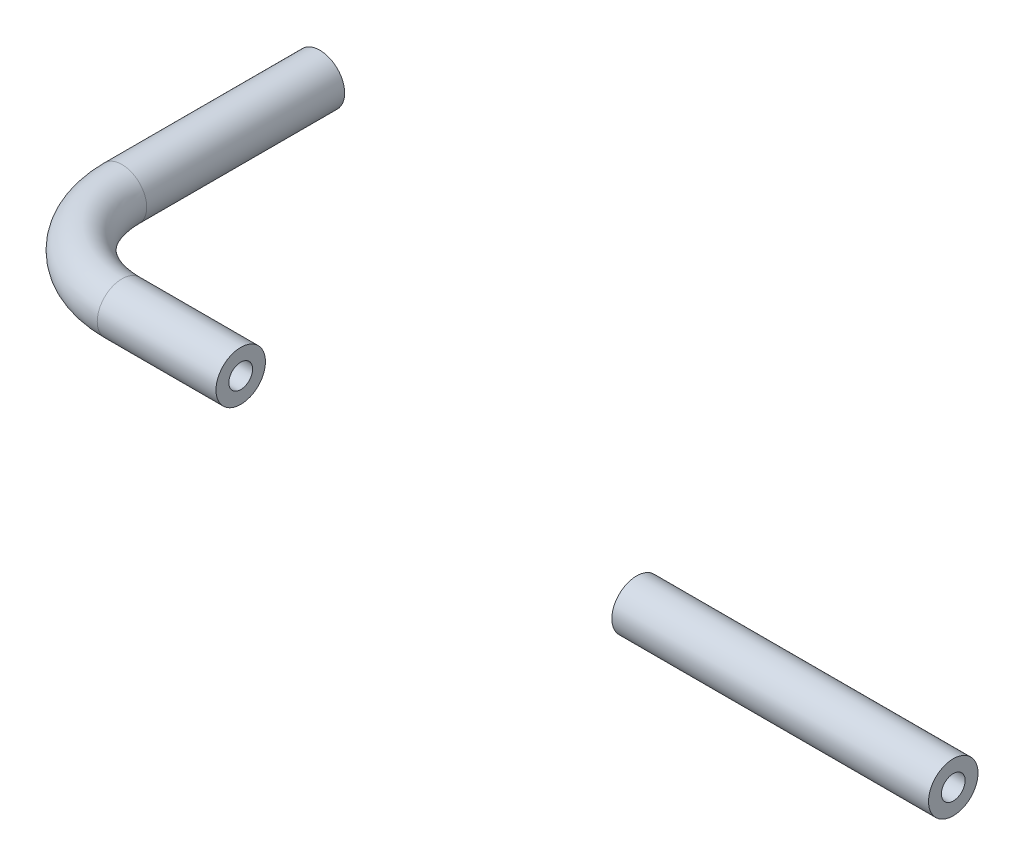
ISO-10303-21;
HEADER;
FILE_DESCRIPTION(('STEP AP214'),'2;1');
FILE_NAME('part.step','',(''),(''),'','','');
FILE_SCHEMA(('AUTOMOTIVE_DESIGN { 1 0 10303 214 1 1 1 1 }'));
ENDSEC;
DATA;
#1=APPLICATION_CONTEXT('core data for automotive mechanical design processes');
#2=APPLICATION_PROTOCOL_DEFINITION('international standard','automotive_design',2000,#1);
#3=PRODUCT_CONTEXT('',#1,'mechanical');
#4=PRODUCT('Part','Part','',(#3));
#5=PRODUCT_RELATED_PRODUCT_CATEGORY('part','',(#4));
#6=PRODUCT_DEFINITION_FORMATION('','',#4);
#7=PRODUCT_DEFINITION_CONTEXT('part definition',#1,'design');
#8=PRODUCT_DEFINITION('design','',#6,#7);
#9=PRODUCT_DEFINITION_SHAPE('','',#8);
#10=(LENGTH_UNIT() NAMED_UNIT(*) SI_UNIT(.MILLI.,.METRE.));
#11=(NAMED_UNIT(*) PLANE_ANGLE_UNIT() SI_UNIT($,.RADIAN.));
#12=(NAMED_UNIT(*) SI_UNIT($,.STERADIAN.) SOLID_ANGLE_UNIT());
#13=UNCERTAINTY_MEASURE_WITH_UNIT(LENGTH_MEASURE(1.E-05),#10,'distance_accuracy_value','');
#14=(GEOMETRIC_REPRESENTATION_CONTEXT(3) GLOBAL_UNCERTAINTY_ASSIGNED_CONTEXT((#13)) GLOBAL_UNIT_ASSIGNED_CONTEXT((#10,
#11,#12)) REPRESENTATION_CONTEXT('',''));
#15=CARTESIAN_POINT('',(0.,0.,0.));
#16=DIRECTION('',(0.,0.,1.));
#17=DIRECTION('',(1.,0.,0.));
#18=AXIS2_PLACEMENT_3D('',#15,#16,#17);
#19=CARTESIAN_POINT('',(50.8,0.,0.));
#20=DIRECTION('',(1.,0.,0.));
#21=DIRECTION('',(0.,0.,-1.));
#22=AXIS2_PLACEMENT_3D('',#19,#20,#21);
#23=PLANE('',#22);
#24=CARTESIAN_POINT('',(50.8,0.,0.));
#25=DIRECTION('',(1.,0.,0.));
#26=DIRECTION('',(0.,0.,-1.));
#27=AXIS2_PLACEMENT_3D('',#24,#25,#26);
#28=CIRCLE('',#27,1.524);
#29=CARTESIAN_POINT('',(50.8,0.,-1.524));
#30=VERTEX_POINT('',#29);
#31=EDGE_CURVE('E71',#30,#30,#28,.T.);
#32=ORIENTED_EDGE('',*,*,#31,.T.);
#33=EDGE_LOOP('',(#32));
#34=FACE_BOUND('',#33,.T.);
#35=CARTESIAN_POINT('',(50.8,0.,0.));
#36=DIRECTION('',(1.,0.,0.));
#37=DIRECTION('',(0.,0.,-1.));
#38=AXIS2_PLACEMENT_3D('',#35,#36,#37);
#39=CIRCLE('',#38,3.175);
#40=CARTESIAN_POINT('',(50.8,0.,-3.175));
#41=VERTEX_POINT('',#40);
#42=EDGE_CURVE('E63',#41,#41,#39,.T.);
#43=ORIENTED_EDGE('',*,*,#42,.F.);
#44=EDGE_LOOP('',(#43));
#45=FACE_BOUND('',#44,.T.);
#46=ADVANCED_FACE('F57',(#34,#45),#23,.F.);
#47=CARTESIAN_POINT('',(91.44,0.,0.));
#48=DIRECTION('',(1.,0.,0.));
#49=DIRECTION('',(0.,0.,-1.));
#50=AXIS2_PLACEMENT_3D('',#47,#48,#49);
#51=PLANE('',#50);
#52=CARTESIAN_POINT('',(91.44,0.,0.));
#53=DIRECTION('',(1.,0.,0.));
#54=DIRECTION('',(0.,0.,-1.));
#55=AXIS2_PLACEMENT_3D('',#52,#53,#54);
#56=CIRCLE('',#55,1.524);
#57=CARTESIAN_POINT('',(91.44,0.,-1.524));
#58=VERTEX_POINT('',#57);
#59=EDGE_CURVE('E67',#58,#58,#56,.T.);
#60=ORIENTED_EDGE('',*,*,#59,.F.);
#61=EDGE_LOOP('',(#60));
#62=FACE_BOUND('',#61,.T.);
#63=CARTESIAN_POINT('',(91.44,0.,0.));
#64=DIRECTION('',(1.,0.,0.));
#65=DIRECTION('',(0.,0.,-1.));
#66=AXIS2_PLACEMENT_3D('',#63,#64,#65);
#67=CIRCLE('',#66,3.175);
#68=CARTESIAN_POINT('',(91.44,0.,-3.175));
#69=VERTEX_POINT('',#68);
#70=EDGE_CURVE('E12',#69,#69,#67,.T.);
#71=ORIENTED_EDGE('',*,*,#70,.T.);
#72=EDGE_LOOP('',(#71));
#73=FACE_BOUND('',#72,.T.);
#74=ADVANCED_FACE('F87',(#62,#73),#51,.T.);
#75=CARTESIAN_POINT('',(50.8,0.,0.));
#76=DIRECTION('',(1.,0.,0.));
#77=DIRECTION('',(0.,0.,-1.));
#78=AXIS2_PLACEMENT_3D('',#75,#76,#77);
#79=CYLINDRICAL_SURFACE('',#78,3.175);
#80=ORIENTED_EDGE('',*,*,#70,.F.);
#81=EDGE_LOOP('',(#80));
#82=FACE_BOUND('',#81,.T.);
#83=ORIENTED_EDGE('',*,*,#42,.T.);
#84=EDGE_LOOP('',(#83));
#85=FACE_BOUND('',#84,.T.);
#86=ADVANCED_FACE('F81',(#82,#85),#79,.T.);
#87=CARTESIAN_POINT('',(50.8,0.,0.));
#88=DIRECTION('',(1.,0.,0.));
#89=DIRECTION('',(0.,0.,-1.));
#90=AXIS2_PLACEMENT_3D('',#87,#88,#89);
#91=CYLINDRICAL_SURFACE('',#90,1.524);
#92=ORIENTED_EDGE('',*,*,#59,.T.);
#93=EDGE_LOOP('',(#92));
#94=FACE_BOUND('',#93,.T.);
#95=ORIENTED_EDGE('',*,*,#31,.F.);
#96=EDGE_LOOP('',(#95));
#97=FACE_BOUND('',#96,.T.);
#98=ADVANCED_FACE('F79',(#94,#97),#91,.F.);
#99=CLOSED_SHELL('',(#46,#74,#86,#98));
#100=MANIFOLD_SOLID_BREP('B2',#99);
#101=CARTESIAN_POINT('',(-27.94,0.,-38.1));
#102=DIRECTION('',(0.,0.,-1.));
#103=DIRECTION('',(-1.,0.,0.));
#104=AXIS2_PLACEMENT_3D('',#101,#102,#103);
#105=PLANE('',#104);
#106=CARTESIAN_POINT('',(-27.94,0.,-38.1));
#107=DIRECTION('',(0.,0.,-1.));
#108=DIRECTION('',(-1.,0.,0.));
#109=AXIS2_PLACEMENT_3D('',#106,#107,#108);
#110=CIRCLE('',#109,1.524);
#111=CARTESIAN_POINT('',(-29.464,0.,-38.1));
#112=VERTEX_POINT('',#111);
#113=EDGE_CURVE('E142',#112,#112,#110,.T.);
#114=ORIENTED_EDGE('',*,*,#113,.F.);
#115=EDGE_LOOP('',(#114));
#116=FACE_BOUND('',#115,.T.);
#117=CARTESIAN_POINT('',(-27.94,0.,-38.1));
#118=DIRECTION('',(0.,0.,-1.));
#119=DIRECTION('',(-1.,0.,0.));
#120=AXIS2_PLACEMENT_3D('',#117,#118,#119);
#121=CIRCLE('',#120,3.175);
#122=CARTESIAN_POINT('',(-31.115,0.,-38.1));
#123=VERTEX_POINT('',#122);
#124=EDGE_CURVE('E133',#123,#123,#121,.T.);
#125=ORIENTED_EDGE('',*,*,#124,.T.);
#126=EDGE_LOOP('',(#125));
#127=FACE_BOUND('',#126,.T.);
#128=ADVANCED_FACE('F119',(#116,#127),#105,.T.);
#129=CARTESIAN_POINT('',(0.,0.,0.));
#130=DIRECTION('',(-1.,0.,0.));
#131=DIRECTION('',(0.,0.,1.));
#132=AXIS2_PLACEMENT_3D('',#129,#130,#131);
#133=PLANE('',#132);
#134=CARTESIAN_POINT('',(0.,0.,0.));
#135=DIRECTION('',(-1.,0.,0.));
#136=DIRECTION('',(0.,0.,1.));
#137=AXIS2_PLACEMENT_3D('',#134,#135,#136);
#138=CIRCLE('',#137,1.524);
#139=CARTESIAN_POINT('',(0.,0.,1.524));
#140=VERTEX_POINT('',#139);
#141=EDGE_CURVE('E138',#140,#140,#138,.T.);
#142=ORIENTED_EDGE('',*,*,#141,.T.);
#143=EDGE_LOOP('',(#142));
#144=FACE_BOUND('',#143,.T.);
#145=CARTESIAN_POINT('',(0.,0.,0.));
#146=DIRECTION('',(-1.,0.,0.));
#147=DIRECTION('',(0.,0.,1.));
#148=AXIS2_PLACEMENT_3D('',#145,#146,#147);
#149=CIRCLE('',#148,3.175);
#150=CARTESIAN_POINT('',(0.,0.,3.175));
#151=VERTEX_POINT('',#150);
#152=EDGE_CURVE('E56',#151,#151,#149,.T.);
#153=ORIENTED_EDGE('',*,*,#152,.F.);
#154=EDGE_LOOP('',(#153));
#155=FACE_BOUND('',#154,.T.);
#156=ADVANCED_FACE('F162',(#144,#155),#133,.F.);
#157=CARTESIAN_POINT('',(-27.94,0.,-38.1));
#158=DIRECTION('',(0.,0.,1.));
#159=DIRECTION('',(1.,0.,0.));
#160=AXIS2_PLACEMENT_3D('',#157,#158,#159);
#161=CYLINDRICAL_SURFACE('',#160,3.175);
#162=CARTESIAN_POINT('',(-27.94,0.,-12.7));
#163=DIRECTION('',(0.,0.,-1.));
#164=DIRECTION('',(-1.,0.,0.));
#165=AXIS2_PLACEMENT_3D('',#162,#163,#164);
#166=CIRCLE('',#165,3.175);
#167=CARTESIAN_POINT('',(-31.115,0.,-12.7));
#168=VERTEX_POINT('',#167);
#169=EDGE_CURVE('E129',#168,#168,#166,.T.);
#170=ORIENTED_EDGE('',*,*,#169,.T.);
#171=EDGE_LOOP('',(#170));
#172=FACE_BOUND('',#171,.T.);
#173=ORIENTED_EDGE('',*,*,#124,.F.);
#174=EDGE_LOOP('',(#173));
#175=FACE_BOUND('',#174,.T.);
#176=ADVANCED_FACE('F166',(#172,#175),#161,.T.);
#177=CARTESIAN_POINT('',(-15.24,0.,-12.7));
#178=DIRECTION('',(0.,1.,0.));
#179=DIRECTION('',(0.,0.,1.));
#180=AXIS2_PLACEMENT_3D('',#177,#178,#179);
#181=TOROIDAL_SURFACE('',#180,12.7,3.175);
#182=CARTESIAN_POINT('',(-15.24,0.,0.));
#183=DIRECTION('',(-1.,0.,0.));
#184=DIRECTION('',(0.,0.,1.));
#185=AXIS2_PLACEMENT_3D('',#182,#183,#184);
#186=CIRCLE('',#185,3.175);
#187=CARTESIAN_POINT('',(-15.24,0.,3.175));
#188=VERTEX_POINT('',#187);
#189=EDGE_CURVE('E125',#188,#188,#186,.T.);
#190=CARTESIAN_POINT('',(-15.24,0.,-12.7));
#191=DIRECTION('',(0.,1.,0.));
#192=DIRECTION('',(0.,0.,1.));
#193=AXIS2_PLACEMENT_3D('',#190,#191,#192);
#194=CIRCLE('',#193,15.875);
#195=EDGE_CURVE('',#168,#188,#194,.T.);
#196=ORIENTED_EDGE('',*,*,#169,.F.);
#197=ORIENTED_EDGE('',*,*,#189,.T.);
#198=ORIENTED_EDGE('',*,*,#195,.T.);
#199=ORIENTED_EDGE('',*,*,#195,.F.);
#200=EDGE_LOOP('',(#196,#198,#197,#199));
#201=FACE_BOUND('',#200,.T.);
#202=ADVANCED_FACE('F168',(#201),#181,.T.);
#203=CARTESIAN_POINT('',(-15.24,0.,0.));
#204=DIRECTION('',(1.,0.,0.));
#205=DIRECTION('',(0.,0.,-1.));
#206=AXIS2_PLACEMENT_3D('',#203,#204,#205);
#207=CYLINDRICAL_SURFACE('',#206,3.175);
#208=ORIENTED_EDGE('',*,*,#152,.T.);
#209=EDGE_LOOP('',(#208));
#210=FACE_BOUND('',#209,.T.);
#211=ORIENTED_EDGE('',*,*,#189,.F.);
#212=EDGE_LOOP('',(#211));
#213=FACE_BOUND('',#212,.T.);
#214=ADVANCED_FACE('F156',(#210,#213),#207,.T.);
#215=CARTESIAN_POINT('',(-27.94,0.,-38.1));
#216=DIRECTION('',(0.,0.,1.));
#217=DIRECTION('',(1.,0.,0.));
#218=AXIS2_PLACEMENT_3D('',#215,#216,#217);
#219=CYLINDRICAL_SURFACE('',#218,1.524);
#220=CARTESIAN_POINT('',(-27.94,0.,-12.7));
#221=DIRECTION('',(0.,0.,1.));
#222=DIRECTION('',(1.,0.,0.));
#223=AXIS2_PLACEMENT_3D('',#220,#221,#222);
#224=CIRCLE('',#223,1.524);
#225=CARTESIAN_POINT('',(-29.464,0.,-12.7));
#226=VERTEX_POINT('',#225);
#227=EDGE_CURVE('E145',#226,#226,#224,.F.);
#228=ORIENTED_EDGE('',*,*,#227,.F.);
#229=EDGE_LOOP('',(#228));
#230=FACE_BOUND('',#229,.T.);
#231=ORIENTED_EDGE('',*,*,#113,.T.);
#232=EDGE_LOOP('',(#231));
#233=FACE_BOUND('',#232,.T.);
#234=ADVANCED_FACE('F153',(#230,#233),#219,.F.);
#235=CARTESIAN_POINT('',(-15.24,0.,-12.7));
#236=DIRECTION('',(0.,1.,0.));
#237=DIRECTION('',(0.,0.,1.));
#238=AXIS2_PLACEMENT_3D('',#235,#236,#237);
#239=TOROIDAL_SURFACE('',#238,12.7,1.524);
#240=CARTESIAN_POINT('',(-15.24,0.,0.));
#241=DIRECTION('',(-1.,0.,0.));
#242=DIRECTION('',(0.,0.,1.));
#243=AXIS2_PLACEMENT_3D('',#240,#241,#242);
#244=CIRCLE('',#243,1.524);
#245=CARTESIAN_POINT('',(-15.24,0.,1.524));
#246=VERTEX_POINT('',#245);
#247=EDGE_CURVE('E141',#246,#246,#244,.T.);
#248=CARTESIAN_POINT('',(-15.24,0.,-12.7));
#249=DIRECTION('',(0.,1.,0.));
#250=DIRECTION('',(0.,0.,1.));
#251=AXIS2_PLACEMENT_3D('',#248,#249,#250);
#252=CIRCLE('',#251,14.224);
#253=EDGE_CURVE('',#226,#246,#252,.T.);
#254=ORIENTED_EDGE('',*,*,#227,.T.);
#255=ORIENTED_EDGE('',*,*,#247,.F.);
#256=ORIENTED_EDGE('',*,*,#253,.T.);
#257=ORIENTED_EDGE('',*,*,#253,.F.);
#258=EDGE_LOOP('',(#254,#256,#255,#257));
#259=FACE_BOUND('',#258,.T.);
#260=ADVANCED_FACE('F151',(#259),#239,.F.);
#261=CARTESIAN_POINT('',(-15.24,0.,0.));
#262=DIRECTION('',(1.,0.,0.));
#263=DIRECTION('',(0.,0.,-1.));
#264=AXIS2_PLACEMENT_3D('',#261,#262,#263);
#265=CYLINDRICAL_SURFACE('',#264,1.524);
#266=ORIENTED_EDGE('',*,*,#141,.F.);
#267=EDGE_LOOP('',(#266));
#268=FACE_BOUND('',#267,.T.);
#269=ORIENTED_EDGE('',*,*,#247,.T.);
#270=EDGE_LOOP('',(#269));
#271=FACE_BOUND('',#270,.T.);
#272=ADVANCED_FACE('F163',(#268,#271),#265,.F.);
#273=CLOSED_SHELL('',(#128,#156,#176,#202,#214,#234,#260,#272));
#274=MANIFOLD_SOLID_BREP('B7',#273);
#275=ADVANCED_BREP_SHAPE_REPRESENTATION('',(#18,#100,#274),#14);
#276=SHAPE_DEFINITION_REPRESENTATION(#9,#275);
ENDSEC;
END-ISO-10303-21;
